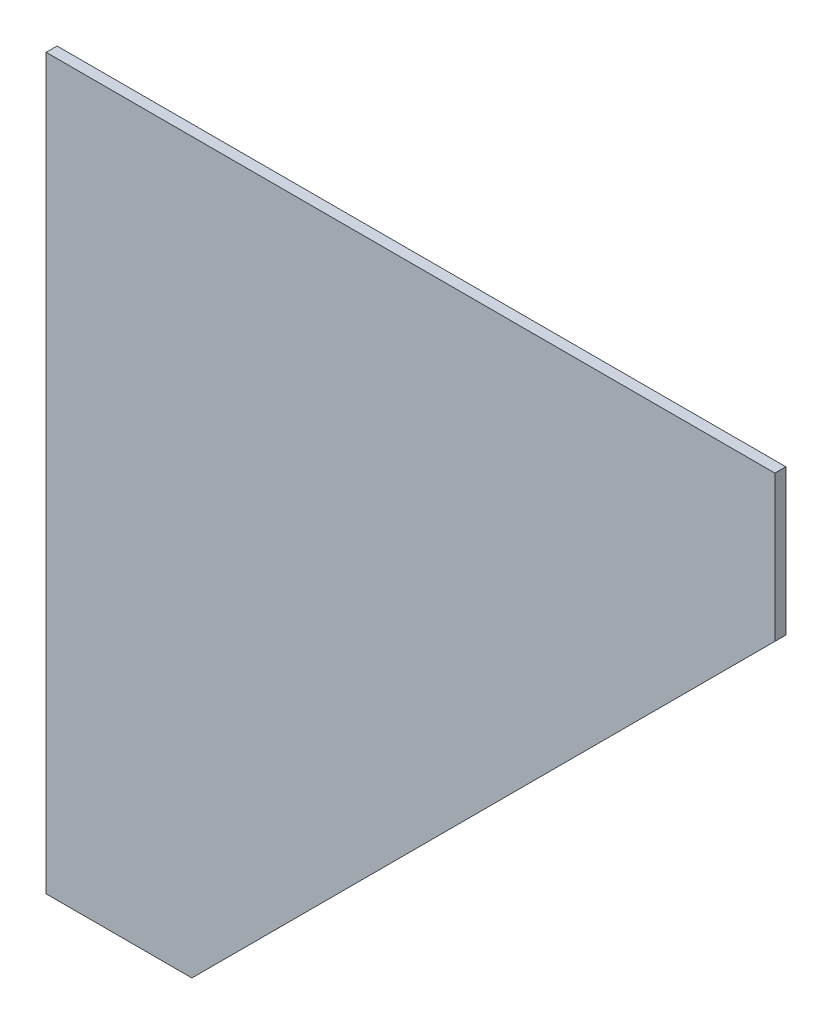
ISO-10303-21;
HEADER;
FILE_DESCRIPTION(('STEP AP214'),'2;1');
FILE_NAME('part.step','',(''),(''),'','','');
FILE_SCHEMA(('AUTOMOTIVE_DESIGN { 1 0 10303 214 1 1 1 1 }'));
ENDSEC;
DATA;
#1=APPLICATION_CONTEXT('core data for automotive mechanical design processes');
#2=APPLICATION_PROTOCOL_DEFINITION('international standard','automotive_design',2000,#1);
#3=PRODUCT_CONTEXT('',#1,'mechanical');
#4=PRODUCT('Part','Part','',(#3));
#5=PRODUCT_RELATED_PRODUCT_CATEGORY('part','',(#4));
#6=PRODUCT_DEFINITION_FORMATION('','',#4);
#7=PRODUCT_DEFINITION_CONTEXT('part definition',#1,'design');
#8=PRODUCT_DEFINITION('design','',#6,#7);
#9=PRODUCT_DEFINITION_SHAPE('','',#8);
#10=(LENGTH_UNIT() NAMED_UNIT(*) SI_UNIT(.MILLI.,.METRE.));
#11=(NAMED_UNIT(*) PLANE_ANGLE_UNIT() SI_UNIT($,.RADIAN.));
#12=(NAMED_UNIT(*) SI_UNIT($,.STERADIAN.) SOLID_ANGLE_UNIT());
#13=UNCERTAINTY_MEASURE_WITH_UNIT(LENGTH_MEASURE(1.E-05),#10,'distance_accuracy_value','');
#14=(GEOMETRIC_REPRESENTATION_CONTEXT(3) GLOBAL_UNCERTAINTY_ASSIGNED_CONTEXT((#13)) GLOBAL_UNIT_ASSIGNED_CONTEXT((#10,
#11,#12)) REPRESENTATION_CONTEXT('',''));
#15=CARTESIAN_POINT('',(0.,0.,0.));
#16=DIRECTION('',(0.,0.,1.));
#17=DIRECTION('',(1.,0.,0.));
#18=AXIS2_PLACEMENT_3D('',#15,#16,#17);
#19=CARTESIAN_POINT('',(40.0000000000018,0.,3.));
#20=DIRECTION('',(0.,1.,0.));
#21=DIRECTION('',(0.,0.,1.));
#22=AXIS2_PLACEMENT_3D('',#19,#20,#21);
#23=PLANE('',#22);
#24=DIRECTION('',(1.,0.,0.));
#25=VECTOR('',#24,1.);
#26=CARTESIAN_POINT('',(40.0000000000018,0.,0.));
#27=LINE('',#26,#25);
#28=CARTESIAN_POINT('',(0.,0.,0.));
#29=VERTEX_POINT('',#28);
#30=CARTESIAN_POINT('',(40.0000000000018,0.,0.));
#31=VERTEX_POINT('',#30);
#32=EDGE_CURVE('E111',#29,#31,#27,.T.);
#33=ORIENTED_EDGE('',*,*,#32,.T.);
#34=DIRECTION('',(0.,0.,-1.));
#35=VECTOR('',#34,1.);
#36=CARTESIAN_POINT('',(40.0000000000018,0.,3.));
#37=LINE('',#36,#35);
#38=CARTESIAN_POINT('',(40.0000000000018,0.,3.));
#39=VERTEX_POINT('',#38);
#40=EDGE_CURVE('E11',#39,#31,#37,.T.);
#41=ORIENTED_EDGE('',*,*,#40,.F.);
#42=DIRECTION('',(1.,0.,0.));
#43=VECTOR('',#42,1.);
#44=CARTESIAN_POINT('',(40.0000000000018,0.,3.));
#45=LINE('',#44,#43);
#46=CARTESIAN_POINT('',(0.,0.,3.));
#47=VERTEX_POINT('',#46);
#48=EDGE_CURVE('E119',#47,#39,#45,.T.);
#49=ORIENTED_EDGE('',*,*,#48,.F.);
#50=DIRECTION('',(0.,0.,-1.));
#51=VECTOR('',#50,1.);
#52=CARTESIAN_POINT('',(0.,0.,3.));
#53=LINE('',#52,#51);
#54=EDGE_CURVE('E107',#47,#29,#53,.T.);
#55=ORIENTED_EDGE('',*,*,#54,.T.);
#56=EDGE_LOOP('',(#33,#41,#49,#55));
#57=FACE_BOUND('',#56,.T.);
#58=ADVANCED_FACE('F37',(#57),#23,.F.);
#59=CARTESIAN_POINT('',(200.,160.,3.));
#60=DIRECTION('',(-0.707106781186552,0.707106781186543,0.));
#61=DIRECTION('',(-0.707106781186543,-0.707106781186552,0.));
#62=AXIS2_PLACEMENT_3D('',#59,#60,#61);
#63=PLANE('',#62);
#64=DIRECTION('',(0.707106781186543,0.707106781186552,0.));
#65=VECTOR('',#64,1.);
#66=CARTESIAN_POINT('',(200.,160.,0.));
#67=LINE('',#66,#65);
#68=CARTESIAN_POINT('',(200.,160.,0.));
#69=VERTEX_POINT('',#68);
#70=EDGE_CURVE('E114',#31,#69,#67,.T.);
#71=ORIENTED_EDGE('',*,*,#70,.T.);
#72=DIRECTION('',(0.,0.,-1.));
#73=VECTOR('',#72,1.);
#74=CARTESIAN_POINT('',(200.,160.,3.));
#75=LINE('',#74,#73);
#76=CARTESIAN_POINT('',(200.,160.,3.));
#77=VERTEX_POINT('',#76);
#78=EDGE_CURVE('E45',#77,#69,#75,.T.);
#79=ORIENTED_EDGE('',*,*,#78,.F.);
#80=DIRECTION('',(0.707106781186543,0.707106781186552,0.));
#81=VECTOR('',#80,1.);
#82=CARTESIAN_POINT('',(200.,160.,3.));
#83=LINE('',#82,#81);
#84=EDGE_CURVE('E87',#39,#77,#83,.T.);
#85=ORIENTED_EDGE('',*,*,#84,.F.);
#86=ORIENTED_EDGE('',*,*,#40,.T.);
#87=EDGE_LOOP('',(#71,#79,#85,#86));
#88=FACE_BOUND('',#87,.T.);
#89=ADVANCED_FACE('F138',(#88),#63,.F.);
#90=CARTESIAN_POINT('',(200.,200.,3.));
#91=DIRECTION('',(-1.,0.,0.));
#92=DIRECTION('',(0.,0.,1.));
#93=AXIS2_PLACEMENT_3D('',#90,#91,#92);
#94=PLANE('',#93);
#95=DIRECTION('',(0.,1.,0.));
#96=VECTOR('',#95,1.);
#97=CARTESIAN_POINT('',(200.,200.,0.));
#98=LINE('',#97,#96);
#99=CARTESIAN_POINT('',(200.,200.,0.));
#100=VERTEX_POINT('',#99);
#101=EDGE_CURVE('E102',#69,#100,#98,.T.);
#102=ORIENTED_EDGE('',*,*,#101,.T.);
#103=DIRECTION('',(0.,0.,-1.));
#104=VECTOR('',#103,1.);
#105=CARTESIAN_POINT('',(200.,200.,3.));
#106=LINE('',#105,#104);
#107=CARTESIAN_POINT('',(200.,200.,3.));
#108=VERTEX_POINT('',#107);
#109=EDGE_CURVE('E99',#108,#100,#106,.T.);
#110=ORIENTED_EDGE('',*,*,#109,.F.);
#111=DIRECTION('',(0.,1.,0.));
#112=VECTOR('',#111,1.);
#113=CARTESIAN_POINT('',(200.,200.,3.));
#114=LINE('',#113,#112);
#115=EDGE_CURVE('E91',#77,#108,#114,.T.);
#116=ORIENTED_EDGE('',*,*,#115,.F.);
#117=ORIENTED_EDGE('',*,*,#78,.T.);
#118=EDGE_LOOP('',(#102,#110,#116,#117));
#119=FACE_BOUND('',#118,.T.);
#120=ADVANCED_FACE('F100',(#119),#94,.F.);
#121=CARTESIAN_POINT('',(0.,200.,3.));
#122=DIRECTION('',(0.,-1.,0.));
#123=DIRECTION('',(0.,0.,-1.));
#124=AXIS2_PLACEMENT_3D('',#121,#122,#123);
#125=PLANE('',#124);
#126=DIRECTION('',(-1.,0.,0.));
#127=VECTOR('',#126,1.);
#128=CARTESIAN_POINT('',(0.,200.,0.));
#129=LINE('',#128,#127);
#130=CARTESIAN_POINT('',(0.,200.,0.));
#131=VERTEX_POINT('',#130);
#132=EDGE_CURVE('E73',#100,#131,#129,.T.);
#133=ORIENTED_EDGE('',*,*,#132,.T.);
#134=DIRECTION('',(0.,0.,-1.));
#135=VECTOR('',#134,1.);
#136=CARTESIAN_POINT('',(0.,200.,3.));
#137=LINE('',#136,#135);
#138=CARTESIAN_POINT('',(0.,200.,3.));
#139=VERTEX_POINT('',#138);
#140=EDGE_CURVE('E103',#139,#131,#137,.T.);
#141=ORIENTED_EDGE('',*,*,#140,.F.);
#142=DIRECTION('',(-1.,0.,0.));
#143=VECTOR('',#142,1.);
#144=CARTESIAN_POINT('',(0.,200.,3.));
#145=LINE('',#144,#143);
#146=EDGE_CURVE('E95',#108,#139,#145,.T.);
#147=ORIENTED_EDGE('',*,*,#146,.F.);
#148=ORIENTED_EDGE('',*,*,#109,.T.);
#149=EDGE_LOOP('',(#133,#141,#147,#148));
#150=FACE_BOUND('',#149,.T.);
#151=ADVANCED_FACE('F105',(#150),#125,.F.);
#152=CARTESIAN_POINT('',(0.,0.,3.));
#153=DIRECTION('',(1.,0.,0.));
#154=DIRECTION('',(0.,0.,-1.));
#155=AXIS2_PLACEMENT_3D('',#152,#153,#154);
#156=PLANE('',#155);
#157=DIRECTION('',(0.,-1.,0.));
#158=VECTOR('',#157,1.);
#159=CARTESIAN_POINT('',(0.,0.,0.));
#160=LINE('',#159,#158);
#161=EDGE_CURVE('E79',#131,#29,#160,.T.);
#162=ORIENTED_EDGE('',*,*,#161,.T.);
#163=ORIENTED_EDGE('',*,*,#54,.F.);
#164=DIRECTION('',(0.,-1.,0.));
#165=VECTOR('',#164,1.);
#166=CARTESIAN_POINT('',(0.,0.,3.));
#167=LINE('',#166,#165);
#168=EDGE_CURVE('E53',#139,#47,#167,.T.);
#169=ORIENTED_EDGE('',*,*,#168,.F.);
#170=ORIENTED_EDGE('',*,*,#140,.T.);
#171=EDGE_LOOP('',(#162,#163,#169,#170));
#172=FACE_BOUND('',#171,.T.);
#173=ADVANCED_FACE('F127',(#172),#156,.F.);
#174=CARTESIAN_POINT('',(0.,0.,3.));
#175=DIRECTION('',(0.,0.,-1.));
#176=DIRECTION('',(-1.,0.,0.));
#177=AXIS2_PLACEMENT_3D('',#174,#175,#176);
#178=PLANE('',#177);
#179=ORIENTED_EDGE('',*,*,#48,.T.);
#180=ORIENTED_EDGE('',*,*,#84,.T.);
#181=ORIENTED_EDGE('',*,*,#115,.T.);
#182=ORIENTED_EDGE('',*,*,#146,.T.);
#183=ORIENTED_EDGE('',*,*,#168,.T.);
#184=EDGE_LOOP('',(#179,#180,#181,#182,#183));
#185=FACE_BOUND('',#184,.T.);
#186=ADVANCED_FACE('F93',(#185),#178,.F.);
#187=CARTESIAN_POINT('',(0.,0.,0.));
#188=DIRECTION('',(0.,0.,-1.));
#189=DIRECTION('',(-1.,0.,0.));
#190=AXIS2_PLACEMENT_3D('',#187,#188,#189);
#191=PLANE('',#190);
#192=ORIENTED_EDGE('',*,*,#32,.F.);
#193=ORIENTED_EDGE('',*,*,#161,.F.);
#194=ORIENTED_EDGE('',*,*,#132,.F.);
#195=ORIENTED_EDGE('',*,*,#101,.F.);
#196=ORIENTED_EDGE('',*,*,#70,.F.);
#197=EDGE_LOOP('',(#192,#193,#194,#195,#196));
#198=FACE_BOUND('',#197,.T.);
#199=ADVANCED_FACE('F123',(#198),#191,.T.);
#200=CLOSED_SHELL('',(#58,#89,#120,#151,#173,#186,#199));
#201=MANIFOLD_SOLID_BREP('B2',#200);
#202=ADVANCED_BREP_SHAPE_REPRESENTATION('',(#18,#201),#14);
#203=SHAPE_DEFINITION_REPRESENTATION(#9,#202);
ENDSEC;
END-ISO-10303-21;
